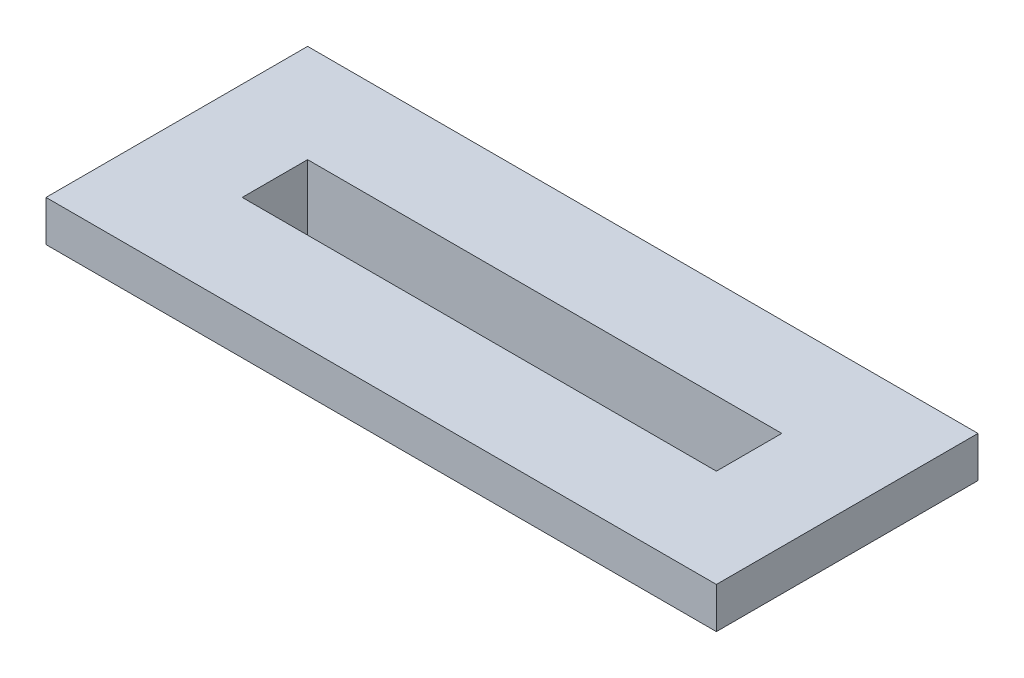
ISO-10303-21;
HEADER;
FILE_DESCRIPTION(('STEP AP214'),'2;1');
FILE_NAME('part.step','',(''),(''),'','','');
FILE_SCHEMA(('AUTOMOTIVE_DESIGN { 1 0 10303 214 1 1 1 1 }'));
ENDSEC;
DATA;
#1=APPLICATION_CONTEXT('core data for automotive mechanical design processes');
#2=APPLICATION_PROTOCOL_DEFINITION('international standard','automotive_design',2000,#1);
#3=PRODUCT_CONTEXT('',#1,'mechanical');
#4=PRODUCT('Part','Part','',(#3));
#5=PRODUCT_RELATED_PRODUCT_CATEGORY('part','',(#4));
#6=PRODUCT_DEFINITION_FORMATION('','',#4);
#7=PRODUCT_DEFINITION_CONTEXT('part definition',#1,'design');
#8=PRODUCT_DEFINITION('design','',#6,#7);
#9=PRODUCT_DEFINITION_SHAPE('','',#8);
#10=(LENGTH_UNIT() NAMED_UNIT(*) SI_UNIT(.MILLI.,.METRE.));
#11=(NAMED_UNIT(*) PLANE_ANGLE_UNIT() SI_UNIT($,.RADIAN.));
#12=(NAMED_UNIT(*) SI_UNIT($,.STERADIAN.) SOLID_ANGLE_UNIT());
#13=UNCERTAINTY_MEASURE_WITH_UNIT(LENGTH_MEASURE(1.E-05),#10,'distance_accuracy_value','');
#14=(GEOMETRIC_REPRESENTATION_CONTEXT(3) GLOBAL_UNCERTAINTY_ASSIGNED_CONTEXT((#13)) GLOBAL_UNIT_ASSIGNED_CONTEXT((#10,
#11,#12)) REPRESENTATION_CONTEXT('',''));
#15=CARTESIAN_POINT('',(0.,0.,0.));
#16=DIRECTION('',(0.,0.,1.));
#17=DIRECTION('',(1.,0.,0.));
#18=AXIS2_PLACEMENT_3D('',#15,#16,#17);
#19=CARTESIAN_POINT('',(0.,-10.,-40.));
#20=DIRECTION('',(0.,0.,1.));
#21=DIRECTION('',(1.,0.,0.));
#22=AXIS2_PLACEMENT_3D('',#19,#20,#21);
#23=PLANE('',#22);
#24=DIRECTION('',(1.,0.,0.));
#25=VECTOR('',#24,1.);
#26=CARTESIAN_POINT('',(0.,40.,-40.));
#27=LINE('',#26,#25);
#28=CARTESIAN_POINT('',(-290.,40.,-40.));
#29=VERTEX_POINT('',#28);
#30=CARTESIAN_POINT('',(290.,40.,-40.));
#31=VERTEX_POINT('',#30);
#32=EDGE_CURVE('E179',#29,#31,#27,.T.);
#33=ORIENTED_EDGE('',*,*,#32,.F.);
#34=DIRECTION('',(0.,1.,0.));
#35=VECTOR('',#34,1.);
#36=CARTESIAN_POINT('',(-290.,-10.,-40.));
#37=LINE('',#36,#35);
#38=CARTESIAN_POINT('',(-290.,-40.,-40.));
#39=VERTEX_POINT('',#38);
#40=EDGE_CURVE('E201',#39,#29,#37,.T.);
#41=ORIENTED_EDGE('',*,*,#40,.F.);
#42=DIRECTION('',(1.,0.,0.));
#43=VECTOR('',#42,1.);
#44=CARTESIAN_POINT('',(0.,-40.,-40.));
#45=LINE('',#44,#43);
#46=CARTESIAN_POINT('',(290.,-40.,-40.));
#47=VERTEX_POINT('',#46);
#48=EDGE_CURVE('E151',#39,#47,#45,.T.);
#49=ORIENTED_EDGE('',*,*,#48,.T.);
#50=DIRECTION('',(0.,1.,0.));
#51=VECTOR('',#50,1.);
#52=CARTESIAN_POINT('',(290.,-10.,-40.));
#53=LINE('',#52,#51);
#54=EDGE_CURVE('E207',#47,#31,#53,.T.);
#55=ORIENTED_EDGE('',*,*,#54,.T.);
#56=EDGE_LOOP('',(#33,#41,#49,#55));
#57=FACE_BOUND('',#56,.T.);
#58=ADVANCED_FACE('F35',(#57),#23,.T.);
#59=CARTESIAN_POINT('',(-290.,-10.,0.));
#60=DIRECTION('',(-1.,0.,0.));
#61=DIRECTION('',(0.,0.,1.));
#62=AXIS2_PLACEMENT_3D('',#59,#60,#61);
#63=PLANE('',#62);
#64=DIRECTION('',(0.,0.,1.));
#65=VECTOR('',#64,1.);
#66=CARTESIAN_POINT('',(-290.,40.,0.));
#67=LINE('',#66,#65);
#68=CARTESIAN_POINT('',(-290.,40.,40.));
#69=VERTEX_POINT('',#68);
#70=EDGE_CURVE('E188',#29,#69,#67,.T.);
#71=ORIENTED_EDGE('',*,*,#70,.T.);
#72=DIRECTION('',(0.,1.,0.));
#73=VECTOR('',#72,1.);
#74=CARTESIAN_POINT('',(-290.,-10.,40.));
#75=LINE('',#74,#73);
#76=CARTESIAN_POINT('',(-290.,-40.,40.));
#77=VERTEX_POINT('',#76);
#78=EDGE_CURVE('E203',#77,#69,#75,.T.);
#79=ORIENTED_EDGE('',*,*,#78,.F.);
#80=DIRECTION('',(0.,0.,1.));
#81=VECTOR('',#80,1.);
#82=CARTESIAN_POINT('',(-290.,-40.,0.));
#83=LINE('',#82,#81);
#84=EDGE_CURVE('E132',#39,#77,#83,.T.);
#85=ORIENTED_EDGE('',*,*,#84,.F.);
#86=ORIENTED_EDGE('',*,*,#40,.T.);
#87=EDGE_LOOP('',(#71,#79,#85,#86));
#88=FACE_BOUND('',#87,.T.);
#89=ADVANCED_FACE('F242',(#88),#63,.F.);
#90=CARTESIAN_POINT('',(0.,-10.,40.));
#91=DIRECTION('',(0.,0.,1.));
#92=DIRECTION('',(1.,0.,0.));
#93=AXIS2_PLACEMENT_3D('',#90,#91,#92);
#94=PLANE('',#93);
#95=DIRECTION('',(1.,0.,0.));
#96=VECTOR('',#95,1.);
#97=CARTESIAN_POINT('',(0.,40.,40.));
#98=LINE('',#97,#96);
#99=CARTESIAN_POINT('',(290.,40.,40.));
#100=VERTEX_POINT('',#99);
#101=EDGE_CURVE('E185',#69,#100,#98,.T.);
#102=ORIENTED_EDGE('',*,*,#101,.T.);
#103=DIRECTION('',(0.,1.,0.));
#104=VECTOR('',#103,1.);
#105=CARTESIAN_POINT('',(290.,-10.,40.));
#106=LINE('',#105,#104);
#107=CARTESIAN_POINT('',(290.,-40.,40.));
#108=VERTEX_POINT('',#107);
#109=EDGE_CURVE('E205',#108,#100,#106,.T.);
#110=ORIENTED_EDGE('',*,*,#109,.F.);
#111=DIRECTION('',(1.,0.,0.));
#112=VECTOR('',#111,1.);
#113=CARTESIAN_POINT('',(0.,-40.,40.));
#114=LINE('',#113,#112);
#115=EDGE_CURVE('E157',#77,#108,#114,.T.);
#116=ORIENTED_EDGE('',*,*,#115,.F.);
#117=ORIENTED_EDGE('',*,*,#78,.T.);
#118=EDGE_LOOP('',(#102,#110,#116,#117));
#119=FACE_BOUND('',#118,.T.);
#120=ADVANCED_FACE('F248',(#119),#94,.F.);
#121=CARTESIAN_POINT('',(410.000000000001,-10.,0.));
#122=DIRECTION('',(-1.,0.,0.));
#123=DIRECTION('',(0.,0.,1.));
#124=AXIS2_PLACEMENT_3D('',#121,#122,#123);
#125=PLANE('',#124);
#126=DIRECTION('',(0.,1.,0.));
#127=VECTOR('',#126,1.);
#128=CARTESIAN_POINT('',(410.000000000001,-10.,-160.));
#129=LINE('',#128,#127);
#130=CARTESIAN_POINT('',(410.000000000001,-10.,-160.));
#131=VERTEX_POINT('',#130);
#132=CARTESIAN_POINT('',(410.000000000001,40.,-160.));
#133=VERTEX_POINT('',#132);
#134=EDGE_CURVE('E200',#131,#133,#129,.T.);
#135=ORIENTED_EDGE('',*,*,#134,.T.);
#136=DIRECTION('',(0.,0.,1.));
#137=VECTOR('',#136,1.);
#138=CARTESIAN_POINT('',(410.000000000001,40.,0.));
#139=LINE('',#138,#137);
#140=CARTESIAN_POINT('',(410.000000000001,40.,160.));
#141=VERTEX_POINT('',#140);
#142=EDGE_CURVE('E163',#133,#141,#139,.T.);
#143=ORIENTED_EDGE('',*,*,#142,.T.);
#144=DIRECTION('',(0.,1.,0.));
#145=VECTOR('',#144,1.);
#146=CARTESIAN_POINT('',(410.000000000001,-10.,160.));
#147=LINE('',#146,#145);
#148=CARTESIAN_POINT('',(410.000000000001,-10.,160.));
#149=VERTEX_POINT('',#148);
#150=EDGE_CURVE('E209',#149,#141,#147,.T.);
#151=ORIENTED_EDGE('',*,*,#150,.F.);
#152=DIRECTION('',(0.,0.,1.));
#153=VECTOR('',#152,1.);
#154=CARTESIAN_POINT('',(410.000000000001,-10.,0.));
#155=LINE('',#154,#153);
#156=EDGE_CURVE('E58',#131,#149,#155,.T.);
#157=ORIENTED_EDGE('',*,*,#156,.F.);
#158=EDGE_LOOP('',(#135,#143,#151,#157));
#159=FACE_BOUND('',#158,.T.);
#160=ADVANCED_FACE('F37',(#159),#125,.F.);
#161=CARTESIAN_POINT('',(0.,-10.,160.));
#162=DIRECTION('',(0.,0.,1.));
#163=DIRECTION('',(1.,0.,0.));
#164=AXIS2_PLACEMENT_3D('',#161,#162,#163);
#165=PLANE('',#164);
#166=ORIENTED_EDGE('',*,*,#150,.T.);
#167=DIRECTION('',(1.,0.,0.));
#168=VECTOR('',#167,1.);
#169=CARTESIAN_POINT('',(0.,40.,160.));
#170=LINE('',#169,#168);
#171=CARTESIAN_POINT('',(-410.000000000001,40.,160.));
#172=VERTEX_POINT('',#171);
#173=EDGE_CURVE('E176',#172,#141,#170,.T.);
#174=ORIENTED_EDGE('',*,*,#173,.F.);
#175=DIRECTION('',(0.,1.,0.));
#176=VECTOR('',#175,1.);
#177=CARTESIAN_POINT('',(-410.000000000001,-10.,160.));
#178=LINE('',#177,#176);
#179=CARTESIAN_POINT('',(-410.000000000001,-10.,160.));
#180=VERTEX_POINT('',#179);
#181=EDGE_CURVE('E211',#180,#172,#178,.T.);
#182=ORIENTED_EDGE('',*,*,#181,.F.);
#183=DIRECTION('',(1.,0.,0.));
#184=VECTOR('',#183,1.);
#185=CARTESIAN_POINT('',(0.,-10.,160.));
#186=LINE('',#185,#184);
#187=EDGE_CURVE('E197',#180,#149,#186,.T.);
#188=ORIENTED_EDGE('',*,*,#187,.T.);
#189=EDGE_LOOP('',(#166,#174,#182,#188));
#190=FACE_BOUND('',#189,.T.);
#191=ADVANCED_FACE('F253',(#190),#165,.T.);
#192=CARTESIAN_POINT('',(-410.000000000001,-10.,0.));
#193=DIRECTION('',(-1.,0.,0.));
#194=DIRECTION('',(0.,0.,1.));
#195=AXIS2_PLACEMENT_3D('',#192,#193,#194);
#196=PLANE('',#195);
#197=ORIENTED_EDGE('',*,*,#181,.T.);
#198=DIRECTION('',(0.,0.,1.));
#199=VECTOR('',#198,1.);
#200=CARTESIAN_POINT('',(-410.000000000001,40.,0.));
#201=LINE('',#200,#199);
#202=CARTESIAN_POINT('',(-410.000000000001,40.,-160.));
#203=VERTEX_POINT('',#202);
#204=EDGE_CURVE('E173',#203,#172,#201,.T.);
#205=ORIENTED_EDGE('',*,*,#204,.F.);
#206=DIRECTION('',(0.,1.,0.));
#207=VECTOR('',#206,1.);
#208=CARTESIAN_POINT('',(-410.000000000001,-10.,-160.));
#209=LINE('',#208,#207);
#210=CARTESIAN_POINT('',(-410.000000000001,-10.,-160.));
#211=VERTEX_POINT('',#210);
#212=EDGE_CURVE('E213',#211,#203,#209,.T.);
#213=ORIENTED_EDGE('',*,*,#212,.F.);
#214=DIRECTION('',(0.,0.,1.));
#215=VECTOR('',#214,1.);
#216=CARTESIAN_POINT('',(-410.000000000001,-10.,0.));
#217=LINE('',#216,#215);
#218=EDGE_CURVE('E194',#211,#180,#217,.T.);
#219=ORIENTED_EDGE('',*,*,#218,.T.);
#220=EDGE_LOOP('',(#197,#205,#213,#219));
#221=FACE_BOUND('',#220,.T.);
#222=ADVANCED_FACE('F256',(#221),#196,.T.);
#223=CARTESIAN_POINT('',(0.,-10.,-160.));
#224=DIRECTION('',(0.,0.,1.));
#225=DIRECTION('',(1.,0.,0.));
#226=AXIS2_PLACEMENT_3D('',#223,#224,#225);
#227=PLANE('',#226);
#228=ORIENTED_EDGE('',*,*,#212,.T.);
#229=DIRECTION('',(1.,0.,0.));
#230=VECTOR('',#229,1.);
#231=CARTESIAN_POINT('',(0.,40.,-160.));
#232=LINE('',#231,#230);
#233=EDGE_CURVE('E170',#203,#133,#232,.T.);
#234=ORIENTED_EDGE('',*,*,#233,.T.);
#235=ORIENTED_EDGE('',*,*,#134,.F.);
#236=DIRECTION('',(1.,0.,0.));
#237=VECTOR('',#236,1.);
#238=CARTESIAN_POINT('',(0.,-10.,-160.));
#239=LINE('',#238,#237);
#240=EDGE_CURVE('E192',#211,#131,#239,.T.);
#241=ORIENTED_EDGE('',*,*,#240,.F.);
#242=EDGE_LOOP('',(#228,#234,#235,#241));
#243=FACE_BOUND('',#242,.T.);
#244=ADVANCED_FACE('F237',(#243),#227,.F.);
#245=CARTESIAN_POINT('',(290.,-10.,0.));
#246=DIRECTION('',(-1.,0.,0.));
#247=DIRECTION('',(0.,0.,1.));
#248=AXIS2_PLACEMENT_3D('',#245,#246,#247);
#249=PLANE('',#248);
#250=DIRECTION('',(0.,0.,1.));
#251=VECTOR('',#250,1.);
#252=CARTESIAN_POINT('',(290.,40.,0.));
#253=LINE('',#252,#251);
#254=EDGE_CURVE('E182',#31,#100,#253,.T.);
#255=ORIENTED_EDGE('',*,*,#254,.F.);
#256=ORIENTED_EDGE('',*,*,#54,.F.);
#257=DIRECTION('',(0.,0.,1.));
#258=VECTOR('',#257,1.);
#259=CARTESIAN_POINT('',(290.,-40.,0.));
#260=LINE('',#259,#258);
#261=EDGE_CURVE('E154',#47,#108,#260,.T.);
#262=ORIENTED_EDGE('',*,*,#261,.T.);
#263=ORIENTED_EDGE('',*,*,#109,.T.);
#264=EDGE_LOOP('',(#255,#256,#262,#263));
#265=FACE_BOUND('',#264,.T.);
#266=ADVANCED_FACE('F229',(#265),#249,.T.);
#267=CARTESIAN_POINT('',(0.,-10.,0.));
#268=DIRECTION('',(0.,1.,0.));
#269=DIRECTION('',(0.,0.,1.));
#270=AXIS2_PLACEMENT_3D('',#267,#268,#269);
#271=PLANE('',#270);
#272=DIRECTION('',(0.,0.,-1.));
#273=VECTOR('',#272,1.);
#274=CARTESIAN_POINT('',(-350.,-10.,0.));
#275=LINE('',#274,#273);
#276=CARTESIAN_POINT('',(-350.,-10.,100.));
#277=VERTEX_POINT('',#276);
#278=CARTESIAN_POINT('',(-350.,-10.,-99.9999999999998));
#279=VERTEX_POINT('',#278);
#280=EDGE_CURVE('E43',#277,#279,#275,.T.);
#281=ORIENTED_EDGE('',*,*,#280,.F.);
#282=DIRECTION('',(1.,0.,0.));
#283=VECTOR('',#282,1.);
#284=CARTESIAN_POINT('',(0.,-10.,99.9999999999999));
#285=LINE('',#284,#283);
#286=CARTESIAN_POINT('',(350.,-10.,99.9999999999999));
#287=VERTEX_POINT('',#286);
#288=EDGE_CURVE('E11',#277,#287,#285,.T.);
#289=ORIENTED_EDGE('',*,*,#288,.T.);
#290=DIRECTION('',(0.,0.,-1.));
#291=VECTOR('',#290,1.);
#292=CARTESIAN_POINT('',(350.,-10.,0.));
#293=LINE('',#292,#291);
#294=CARTESIAN_POINT('',(350.,-10.,-99.9999999999999));
#295=VERTEX_POINT('',#294);
#296=EDGE_CURVE('E129',#287,#295,#293,.T.);
#297=ORIENTED_EDGE('',*,*,#296,.T.);
#298=DIRECTION('',(1.,0.,0.));
#299=VECTOR('',#298,1.);
#300=CARTESIAN_POINT('',(0.,-10.,-99.9999999999998));
#301=LINE('',#300,#299);
#302=EDGE_CURVE('E217',#279,#295,#301,.T.);
#303=ORIENTED_EDGE('',*,*,#302,.F.);
#304=EDGE_LOOP('',(#281,#289,#297,#303));
#305=FACE_BOUND('',#304,.T.);
#306=ORIENTED_EDGE('',*,*,#156,.T.);
#307=ORIENTED_EDGE('',*,*,#187,.F.);
#308=ORIENTED_EDGE('',*,*,#218,.F.);
#309=ORIENTED_EDGE('',*,*,#240,.T.);
#310=EDGE_LOOP('',(#306,#307,#308,#309));
#311=FACE_BOUND('',#310,.T.);
#312=ADVANCED_FACE('F226',(#305,#311),#271,.F.);
#313=CARTESIAN_POINT('',(0.,40.,0.));
#314=DIRECTION('',(0.,1.,0.));
#315=DIRECTION('',(0.,0.,1.));
#316=AXIS2_PLACEMENT_3D('',#313,#314,#315);
#317=PLANE('',#316);
#318=ORIENTED_EDGE('',*,*,#142,.F.);
#319=ORIENTED_EDGE('',*,*,#233,.F.);
#320=ORIENTED_EDGE('',*,*,#204,.T.);
#321=ORIENTED_EDGE('',*,*,#173,.T.);
#322=EDGE_LOOP('',(#318,#319,#320,#321));
#323=FACE_BOUND('',#322,.T.);
#324=ORIENTED_EDGE('',*,*,#32,.T.);
#325=ORIENTED_EDGE('',*,*,#254,.T.);
#326=ORIENTED_EDGE('',*,*,#101,.F.);
#327=ORIENTED_EDGE('',*,*,#70,.F.);
#328=EDGE_LOOP('',(#324,#325,#326,#327));
#329=FACE_BOUND('',#328,.T.);
#330=ADVANCED_FACE('F228',(#323,#329),#317,.T.);
#331=CARTESIAN_POINT('',(0.,-40.,99.9999999999999));
#332=DIRECTION('',(0.,0.,1.));
#333=DIRECTION('',(1.,0.,0.));
#334=AXIS2_PLACEMENT_3D('',#331,#332,#333);
#335=PLANE('',#334);
#336=ORIENTED_EDGE('',*,*,#288,.F.);
#337=DIRECTION('',(0.,1.,0.));
#338=VECTOR('',#337,1.);
#339=CARTESIAN_POINT('',(-350.,-40.,100.));
#340=LINE('',#339,#338);
#341=CARTESIAN_POINT('',(-350.,-40.,100.));
#342=VERTEX_POINT('',#341);
#343=EDGE_CURVE('E144',#342,#277,#340,.T.);
#344=ORIENTED_EDGE('',*,*,#343,.F.);
#345=DIRECTION('',(1.,0.,0.));
#346=VECTOR('',#345,1.);
#347=CARTESIAN_POINT('',(0.,-40.,99.9999999999999));
#348=LINE('',#347,#346);
#349=CARTESIAN_POINT('',(350.,-40.,99.9999999999999));
#350=VERTEX_POINT('',#349);
#351=EDGE_CURVE('E138',#342,#350,#348,.T.);
#352=ORIENTED_EDGE('',*,*,#351,.T.);
#353=DIRECTION('',(0.,1.,0.));
#354=VECTOR('',#353,1.);
#355=CARTESIAN_POINT('',(350.,-40.,99.9999999999999));
#356=LINE('',#355,#354);
#357=EDGE_CURVE('E124',#350,#287,#356,.T.);
#358=ORIENTED_EDGE('',*,*,#357,.T.);
#359=EDGE_LOOP('',(#336,#344,#352,#358));
#360=FACE_BOUND('',#359,.T.);
#361=ADVANCED_FACE('F142',(#360),#335,.T.);
#362=CARTESIAN_POINT('',(-350.,-40.,0.));
#363=DIRECTION('',(1.,0.,0.));
#364=DIRECTION('',(0.,0.,-1.));
#365=AXIS2_PLACEMENT_3D('',#362,#363,#364);
#366=PLANE('',#365);
#367=ORIENTED_EDGE('',*,*,#343,.T.);
#368=ORIENTED_EDGE('',*,*,#280,.T.);
#369=DIRECTION('',(0.,1.,0.));
#370=VECTOR('',#369,1.);
#371=CARTESIAN_POINT('',(-350.,-40.,-99.9999999999998));
#372=LINE('',#371,#370);
#373=CARTESIAN_POINT('',(-350.,-40.,-99.9999999999998));
#374=VERTEX_POINT('',#373);
#375=EDGE_CURVE('E164',#374,#279,#372,.T.);
#376=ORIENTED_EDGE('',*,*,#375,.F.);
#377=DIRECTION('',(0.,0.,-1.));
#378=VECTOR('',#377,1.);
#379=CARTESIAN_POINT('',(-350.,-40.,0.));
#380=LINE('',#379,#378);
#381=EDGE_CURVE('E149',#342,#374,#380,.T.);
#382=ORIENTED_EDGE('',*,*,#381,.F.);
#383=EDGE_LOOP('',(#367,#368,#376,#382));
#384=FACE_BOUND('',#383,.T.);
#385=ADVANCED_FACE('F221',(#384),#366,.F.);
#386=CARTESIAN_POINT('',(0.,-40.,-99.9999999999998));
#387=DIRECTION('',(0.,0.,1.));
#388=DIRECTION('',(1.,0.,0.));
#389=AXIS2_PLACEMENT_3D('',#386,#387,#388);
#390=PLANE('',#389);
#391=ORIENTED_EDGE('',*,*,#375,.T.);
#392=ORIENTED_EDGE('',*,*,#302,.T.);
#393=DIRECTION('',(0.,1.,0.));
#394=VECTOR('',#393,1.);
#395=CARTESIAN_POINT('',(350.,-40.,-99.9999999999999));
#396=LINE('',#395,#394);
#397=CARTESIAN_POINT('',(350.,-40.,-99.9999999999999));
#398=VERTEX_POINT('',#397);
#399=EDGE_CURVE('E50',#398,#295,#396,.T.);
#400=ORIENTED_EDGE('',*,*,#399,.F.);
#401=DIRECTION('',(1.,0.,0.));
#402=VECTOR('',#401,1.);
#403=CARTESIAN_POINT('',(0.,-40.,-99.9999999999998));
#404=LINE('',#403,#402);
#405=EDGE_CURVE('E140',#374,#398,#404,.T.);
#406=ORIENTED_EDGE('',*,*,#405,.F.);
#407=EDGE_LOOP('',(#391,#392,#400,#406));
#408=FACE_BOUND('',#407,.T.);
#409=ADVANCED_FACE('F225',(#408),#390,.F.);
#410=CARTESIAN_POINT('',(350.,-40.,0.));
#411=DIRECTION('',(1.,0.,0.));
#412=DIRECTION('',(0.,0.,-1.));
#413=AXIS2_PLACEMENT_3D('',#410,#411,#412);
#414=PLANE('',#413);
#415=ORIENTED_EDGE('',*,*,#296,.F.);
#416=ORIENTED_EDGE('',*,*,#357,.F.);
#417=DIRECTION('',(0.,0.,-1.));
#418=VECTOR('',#417,1.);
#419=CARTESIAN_POINT('',(350.,-40.,0.));
#420=LINE('',#419,#418);
#421=EDGE_CURVE('E127',#350,#398,#420,.T.);
#422=ORIENTED_EDGE('',*,*,#421,.T.);
#423=ORIENTED_EDGE('',*,*,#399,.T.);
#424=EDGE_LOOP('',(#415,#416,#422,#423));
#425=FACE_BOUND('',#424,.T.);
#426=ADVANCED_FACE('F126',(#425),#414,.T.);
#427=CARTESIAN_POINT('',(0.,-40.,0.));
#428=DIRECTION('',(0.,1.,0.));
#429=DIRECTION('',(0.,0.,1.));
#430=AXIS2_PLACEMENT_3D('',#427,#428,#429);
#431=PLANE('',#430);
#432=ORIENTED_EDGE('',*,*,#351,.F.);
#433=ORIENTED_EDGE('',*,*,#381,.T.);
#434=ORIENTED_EDGE('',*,*,#405,.T.);
#435=ORIENTED_EDGE('',*,*,#421,.F.);
#436=EDGE_LOOP('',(#432,#433,#434,#435));
#437=FACE_BOUND('',#436,.T.);
#438=ORIENTED_EDGE('',*,*,#48,.F.);
#439=ORIENTED_EDGE('',*,*,#84,.T.);
#440=ORIENTED_EDGE('',*,*,#115,.T.);
#441=ORIENTED_EDGE('',*,*,#261,.F.);
#442=EDGE_LOOP('',(#438,#439,#440,#441));
#443=FACE_BOUND('',#442,.T.);
#444=ADVANCED_FACE('F136',(#437,#443),#431,.F.);
#445=CLOSED_SHELL('',(#58,#89,#120,#160,#191,#222,#244,#266,#312,#330,#361,#385,#409,#426,#444));
#446=MANIFOLD_SOLID_BREP('B2',#445);
#447=ADVANCED_BREP_SHAPE_REPRESENTATION('',(#18,#446),#14);
#448=SHAPE_DEFINITION_REPRESENTATION(#9,#447);
ENDSEC;
END-ISO-10303-21;
